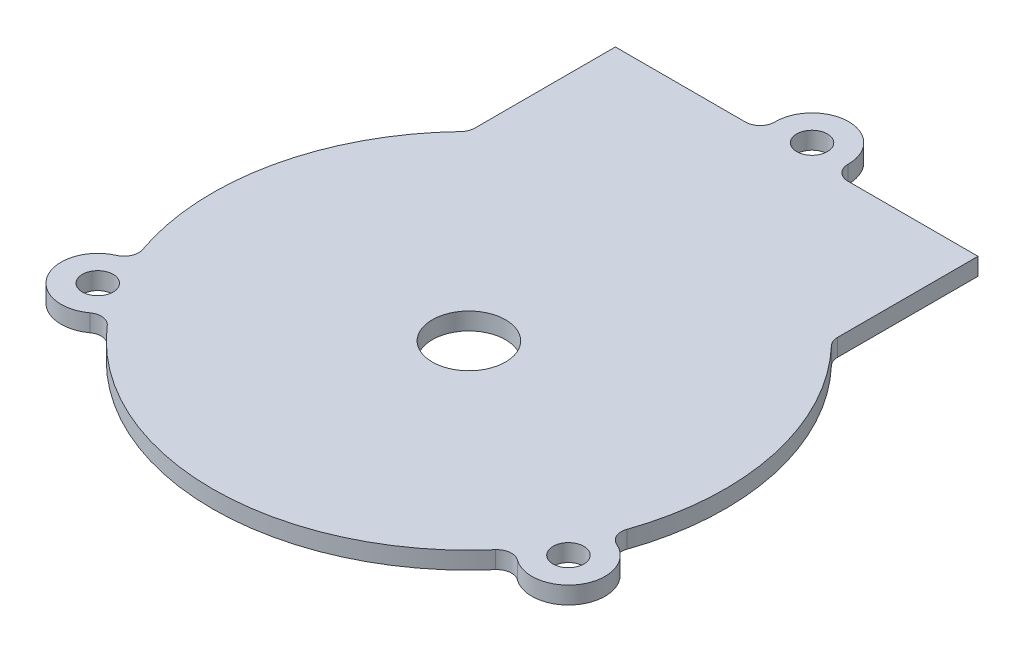
ISO-10303-21;
HEADER;
FILE_DESCRIPTION(('STEP AP214'),'2;1');
FILE_NAME('part.step','',(''),(''),'','','');
FILE_SCHEMA(('AUTOMOTIVE_DESIGN { 1 0 10303 214 1 1 1 1 }'));
ENDSEC;
DATA;
#1=APPLICATION_CONTEXT('core data for automotive mechanical design processes');
#2=APPLICATION_PROTOCOL_DEFINITION('international standard','automotive_design',2000,#1);
#3=PRODUCT_CONTEXT('',#1,'mechanical');
#4=PRODUCT('Part','Part','',(#3));
#5=PRODUCT_RELATED_PRODUCT_CATEGORY('part','',(#4));
#6=PRODUCT_DEFINITION_FORMATION('','',#4);
#7=PRODUCT_DEFINITION_CONTEXT('part definition',#1,'design');
#8=PRODUCT_DEFINITION('design','',#6,#7);
#9=PRODUCT_DEFINITION_SHAPE('','',#8);
#10=(LENGTH_UNIT() NAMED_UNIT(*) SI_UNIT(.MILLI.,.METRE.));
#11=(NAMED_UNIT(*) PLANE_ANGLE_UNIT() SI_UNIT($,.RADIAN.));
#12=(NAMED_UNIT(*) SI_UNIT($,.STERADIAN.) SOLID_ANGLE_UNIT());
#13=UNCERTAINTY_MEASURE_WITH_UNIT(LENGTH_MEASURE(1.E-05),#10,'distance_accuracy_value','');
#14=(GEOMETRIC_REPRESENTATION_CONTEXT(3) GLOBAL_UNCERTAINTY_ASSIGNED_CONTEXT((#13)) GLOBAL_UNIT_ASSIGNED_CONTEXT((#10,
#11,#12)) REPRESENTATION_CONTEXT('',''));
#15=CARTESIAN_POINT('',(0.,0.,0.));
#16=DIRECTION('',(0.,0.,1.));
#17=DIRECTION('',(1.,0.,0.));
#18=AXIS2_PLACEMENT_3D('',#15,#16,#17);
#19=CARTESIAN_POINT('',(0.,2.3622,0.));
#20=DIRECTION('',(0.,-1.,0.));
#21=DIRECTION('',(0.,0.,-1.));
#22=AXIS2_PLACEMENT_3D('',#19,#20,#21);
#23=CYLINDRICAL_SURFACE('',#22,35.);
#24=CARTESIAN_POINT('',(0.,0.,0.));
#25=DIRECTION('',(0.,1.,0.));
#26=DIRECTION('',(0.,0.,1.));
#27=AXIS2_PLACEMENT_3D('',#24,#25,#26);
#28=CIRCLE('',#27,35.);
#29=CARTESIAN_POINT('',(-25.3019754085747,0.,-24.1828459951239));
#30=VERTEX_POINT('',#29);
#31=CARTESIAN_POINT('',(-33.072840065109,0.,11.4537002766671));
#32=VERTEX_POINT('',#31);
#33=EDGE_CURVE('E213',#30,#32,#28,.T.);
#34=ORIENTED_EDGE('',*,*,#33,.T.);
#35=DIRECTION('',(0.,-1.,0.));
#36=VECTOR('',#35,1.);
#37=CARTESIAN_POINT('',(-33.072840065109,2.3622,11.4537002766671));
#38=LINE('',#37,#36);
#39=CARTESIAN_POINT('',(-33.072840065109,2.3622,11.4537002766671));
#40=VERTEX_POINT('',#39);
#41=EDGE_CURVE('E226',#32,#40,#38,.F.);
#42=ORIENTED_EDGE('',*,*,#41,.T.);
#43=CARTESIAN_POINT('',(0.,2.3622,0.));
#44=DIRECTION('',(0.,1.,0.));
#45=DIRECTION('',(0.,0.,1.));
#46=AXIS2_PLACEMENT_3D('',#43,#44,#45);
#47=CIRCLE('',#46,35.);
#48=CARTESIAN_POINT('',(-25.3019754085747,2.3622,-24.1828459951239));
#49=VERTEX_POINT('',#48);
#50=EDGE_CURVE('E207',#49,#40,#47,.T.);
#51=ORIENTED_EDGE('',*,*,#50,.F.);
#52=DIRECTION('',(0.,-1.,0.));
#53=VECTOR('',#52,1.);
#54=CARTESIAN_POINT('',(-25.3019754085747,2.3622,-24.1828459951239));
#55=LINE('',#54,#53);
#56=EDGE_CURVE('E220',#49,#30,#55,.T.);
#57=ORIENTED_EDGE('',*,*,#56,.T.);
#58=EDGE_LOOP('',(#34,#42,#51,#57));
#59=FACE_BOUND('',#58,.T.);
#60=ADVANCED_FACE('F45',(#59),#23,.T.);
#61=CARTESIAN_POINT('',(-26.5021889393046,0.,22.8611894140572));
#62=VERTEX_POINT('',#61);
#63=CARTESIAN_POINT('',(26.4887144081727,0.,22.8768006723464));
#64=VERTEX_POINT('',#63);
#65=EDGE_CURVE('E216',#62,#64,#28,.T.);
#66=ORIENTED_EDGE('',*,*,#65,.T.);
#67=DIRECTION('',(0.,-1.,0.));
#68=VECTOR('',#67,1.);
#69=CARTESIAN_POINT('',(26.4887144081727,2.3622,22.8768006723464));
#70=LINE('',#69,#68);
#71=CARTESIAN_POINT('',(26.4887144081727,2.3622,22.8768006723464));
#72=VERTEX_POINT('',#71);
#73=EDGE_CURVE('E245',#64,#72,#70,.F.);
#74=ORIENTED_EDGE('',*,*,#73,.T.);
#75=CARTESIAN_POINT('',(-26.5021889393046,2.3622,22.8611894140572));
#76=VERTEX_POINT('',#75);
#77=EDGE_CURVE('E211',#76,#72,#47,.T.);
#78=ORIENTED_EDGE('',*,*,#77,.F.);
#79=DIRECTION('',(0.,-1.,0.));
#80=VECTOR('',#79,1.);
#81=CARTESIAN_POINT('',(-26.5021889393046,2.3622,22.8611894140572));
#82=LINE('',#81,#80);
#83=EDGE_CURVE('E236',#76,#62,#82,.T.);
#84=ORIENTED_EDGE('',*,*,#83,.T.);
#85=EDGE_LOOP('',(#66,#74,#78,#84));
#86=FACE_BOUND('',#85,.T.);
#87=ADVANCED_FACE('F368',(#86),#23,.T.);
#88=CARTESIAN_POINT('',(-24.7478605121482,-53.381962685779,-44.7452325826062));
#89=DIRECTION('',(3.0206381024394E-06,0.,0.999999999995438));
#90=DIRECTION('',(0.999999999995438,0.,-3.0206381024394E-06));
#91=AXIS2_PLACEMENT_3D('',#88,#89,#90);
#92=PLANE('',#91);
#93=DIRECTION('',(0.999999999995438,0.,-3.0206381024394E-06));
#94=VECTOR('',#93,1.);
#95=CARTESIAN_POINT('',(-24.7478605121482,2.3622,-44.7452325826062));
#96=LINE('',#95,#94);
#97=CARTESIAN_POINT('',(-24.7478605121482,2.3622,-44.7452325826062));
#98=VERTEX_POINT('',#97);
#99=CARTESIAN_POINT('',(-6.99532394188785,2.3622,-44.7452862065945));
#100=VERTEX_POINT('',#99);
#101=EDGE_CURVE('E179',#98,#100,#96,.T.);
#102=ORIENTED_EDGE('',*,*,#101,.T.);
#103=DIRECTION('',(0.,1.,0.));
#104=VECTOR('',#103,1.);
#105=CARTESIAN_POINT('',(-6.99532394188785,-53.381962685779,-44.7452862065945));
#106=LINE('',#105,#104);
#107=CARTESIAN_POINT('',(-6.99532394188785,0.,-44.7452862065945));
#108=VERTEX_POINT('',#107);
#109=EDGE_CURVE('E280',#100,#108,#106,.F.);
#110=ORIENTED_EDGE('',*,*,#109,.T.);
#111=DIRECTION('',(-0.999999999995438,0.,3.0206381024394E-06));
#112=VECTOR('',#111,1.);
#113=CARTESIAN_POINT('',(-24.7478605121482,0.,-44.7452325826062));
#114=LINE('',#113,#112);
#115=CARTESIAN_POINT('',(-24.7478605121482,0.,-44.7452325826062));
#116=VERTEX_POINT('',#115);
#117=EDGE_CURVE('E200',#108,#116,#114,.T.);
#118=ORIENTED_EDGE('',*,*,#117,.T.);
#119=DIRECTION('',(0.,1.,0.));
#120=VECTOR('',#119,1.);
#121=CARTESIAN_POINT('',(-24.7478605121482,-53.381962685779,-44.7452325826062));
#122=LINE('',#121,#120);
#123=EDGE_CURVE('E196',#116,#98,#122,.T.);
#124=ORIENTED_EDGE('',*,*,#123,.T.);
#125=EDGE_LOOP('',(#102,#110,#118,#124));
#126=FACE_BOUND('',#125,.T.);
#127=ADVANCED_FACE('F286',(#126),#92,.F.);
#128=CARTESIAN_POINT('',(33.0630730181294,0.,11.4818640733046));
#129=VERTEX_POINT('',#128);
#130=CARTESIAN_POINT('',(25.3018293128609,0.,-24.1829988509046));
#131=VERTEX_POINT('',#130);
#132=EDGE_CURVE('E217',#129,#131,#28,.T.);
#133=ORIENTED_EDGE('',*,*,#132,.T.);
#134=DIRECTION('',(0.,-1.,0.));
#135=VECTOR('',#134,1.);
#136=CARTESIAN_POINT('',(25.3018293128609,2.3622,-24.1829988509046));
#137=LINE('',#136,#135);
#138=CARTESIAN_POINT('',(25.3018293128609,2.3622,-24.1829988509046));
#139=VERTEX_POINT('',#138);
#140=EDGE_CURVE('E264',#131,#139,#137,.F.);
#141=ORIENTED_EDGE('',*,*,#140,.T.);
#142=CARTESIAN_POINT('',(33.0630730181294,2.3622,11.4818640733046));
#143=VERTEX_POINT('',#142);
#144=EDGE_CURVE('E212',#143,#139,#47,.T.);
#145=ORIENTED_EDGE('',*,*,#144,.F.);
#146=DIRECTION('',(0.,-1.,0.));
#147=VECTOR('',#146,1.);
#148=CARTESIAN_POINT('',(33.0630730181294,2.3622,11.4818640733046));
#149=LINE('',#148,#147);
#150=EDGE_CURVE('E255',#143,#129,#149,.T.);
#151=ORIENTED_EDGE('',*,*,#150,.T.);
#152=EDGE_LOOP('',(#133,#141,#145,#151));
#153=FACE_BOUND('',#152,.T.);
#154=ADVANCED_FACE('F345',(#153),#23,.T.);
#155=CARTESIAN_POINT('',(0.,2.3622,0.));
#156=DIRECTION('',(0.,1.,0.));
#157=DIRECTION('',(0.,0.,1.));
#158=AXIS2_PLACEMENT_3D('',#155,#156,#157);
#159=PLANE('',#158);
#160=CARTESIAN_POINT('',(0.,2.3622,0.));
#161=DIRECTION('',(0.,1.,0.));
#162=DIRECTION('',(0.,0.,1.));
#163=AXIS2_PLACEMENT_3D('',#160,#161,#162);
#164=CIRCLE('',#163,5.);
#165=CARTESIAN_POINT('',(0.,2.3622,5.));
#166=VERTEX_POINT('',#165);
#167=EDGE_CURVE('E337',#166,#166,#164,.T.);
#168=ORIENTED_EDGE('',*,*,#167,.F.);
#169=EDGE_LOOP('',(#168));
#170=FACE_BOUND('',#169,.T.);
#171=CARTESIAN_POINT('',(-32.1480166138315,2.3622,18.5087961651664));
#172=DIRECTION('',(0.,1.,0.));
#173=DIRECTION('',(0.,0.,1.));
#174=AXIS2_PLACEMENT_3D('',#171,#172,#173);
#175=CIRCLE('',#174,2.09999999999999);
#176=CARTESIAN_POINT('',(-32.1480166138315,2.3622,20.6087961651664));
#177=VERTEX_POINT('',#176);
#178=EDGE_CURVE('E331',#177,#177,#175,.T.);
#179=ORIENTED_EDGE('',*,*,#178,.F.);
#180=EDGE_LOOP('',(#179));
#181=FACE_BOUND('',#180,.T.);
#182=DIRECTION('',(-3.02063810260161E-06,0.,-0.999999999995438));
#183=VECTOR('',#182,1.);
#184=CARTESIAN_POINT('',(-24.7478001128037,2.3622,-24.7496745347634));
#185=LINE('',#184,#183);
#186=CARTESIAN_POINT('',(-24.7478025747881,2.3622,-25.5647289504072));
#187=VERTEX_POINT('',#186);
#188=EDGE_CURVE('E197',#187,#98,#185,.T.);
#189=ORIENTED_EDGE('',*,*,#188,.F.);
#190=CARTESIAN_POINT('',(-26.747802574779,2.3622,-25.564722909131));
#191=DIRECTION('',(0.,1.,0.));
#192=DIRECTION('',(0.,0.,1.));
#193=AXIS2_PLACEMENT_3D('',#190,#191,#192);
#194=CIRCLE('',#193,2.);
#195=EDGE_CURVE('E222',#187,#49,#194,.F.);
#196=ORIENTED_EDGE('',*,*,#195,.T.);
#197=ORIENTED_EDGE('',*,*,#50,.T.);
#198=CARTESIAN_POINT('',(-34.9627166402581,2.3622,12.1081974353338));
#199=DIRECTION('',(0.,1.,0.));
#200=DIRECTION('',(0.,0.,1.));
#201=AXIS2_PLACEMENT_3D('',#198,#199,#200);
#202=CIRCLE('',#201,2.);
#203=CARTESIAN_POINT('',(-34.1580179965192,2.3622,13.9391698799011));
#204=VERTEX_POINT('',#203);
#205=EDGE_CURVE('E232',#40,#204,#202,.F.);
#206=ORIENTED_EDGE('',*,*,#205,.T.);
#207=CARTESIAN_POINT('',(-32.1464555555357,2.3622,18.5161819435163));
#208=DIRECTION('',(0.,1.,0.));
#209=DIRECTION('',(0.,0.,1.));
#210=AXIS2_PLACEMENT_3D('',#207,#208,#209);
#211=CIRCLE('',#210,4.99954226749351);
#212=CARTESIAN_POINT('',(-29.1966357044392,2.3622,22.5527628891349));
#213=VERTEX_POINT('',#212);
#214=EDGE_CURVE('E325',#204,#213,#211,.T.);
#215=ORIENTED_EDGE('',*,*,#214,.T.);
#216=CARTESIAN_POINT('',(-28.0165997358363,2.3622,24.1675430948605));
#217=DIRECTION('',(0.,1.,0.));
#218=DIRECTION('',(0.,0.,1.));
#219=AXIS2_PLACEMENT_3D('',#216,#217,#218);
#220=CIRCLE('',#219,2.);
#221=EDGE_CURVE('E243',#213,#76,#220,.F.);
#222=ORIENTED_EDGE('',*,*,#221,.T.);
#223=ORIENTED_EDGE('',*,*,#77,.T.);
#224=CARTESIAN_POINT('',(28.0023552314968,2.3622,24.1840464250519));
#225=DIRECTION('',(0.,1.,0.));
#226=DIRECTION('',(0.,0.,1.));
#227=AXIS2_PLACEMENT_3D('',#224,#225,#226);
#228=CIRCLE('',#227,2.);
#229=CARTESIAN_POINT('',(29.184359284545,2.3622,22.5707062815676));
#230=VERTEX_POINT('',#229);
#231=EDGE_CURVE('E251',#72,#230,#228,.F.);
#232=ORIENTED_EDGE('',*,*,#231,.T.);
#233=CARTESIAN_POINT('',(32.1364886347761,2.3622,18.5412879583363));
#234=DIRECTION('',(0.,1.,0.));
#235=DIRECTION('',(0.,0.,1.));
#236=AXIS2_PLACEMENT_3D('',#233,#234,#235);
#237=CIRCLE('',#236,4.9951255964279);
#238=CARTESIAN_POINT('',(34.147287178261,2.3622,13.9687647007018));
#239=VERTEX_POINT('',#238);
#240=EDGE_CURVE('E314',#230,#239,#237,.T.);
#241=ORIENTED_EDGE('',*,*,#240,.T.);
#242=CARTESIAN_POINT('',(34.9523914763083,2.3622,12.1379705917791));
#243=DIRECTION('',(0.,1.,0.));
#244=DIRECTION('',(0.,0.,1.));
#245=AXIS2_PLACEMENT_3D('',#242,#243,#244);
#246=CIRCLE('',#245,2.);
#247=EDGE_CURVE('E262',#239,#143,#246,.F.);
#248=ORIENTED_EDGE('',*,*,#247,.T.);
#249=ORIENTED_EDGE('',*,*,#144,.T.);
#250=CARTESIAN_POINT('',(26.7476481307387,2.3622,-25.5648844995277));
#251=DIRECTION('',(0.,1.,0.));
#252=DIRECTION('',(0.,0.,1.));
#253=AXIS2_PLACEMENT_3D('',#250,#251,#252);
#254=CIRCLE('',#253,2.);
#255=CARTESIAN_POINT('',(24.7476481307478,2.3622,-25.5648784582515));
#256=VERTEX_POINT('',#255);
#257=EDGE_CURVE('E187',#139,#256,#254,.F.);
#258=ORIENTED_EDGE('',*,*,#257,.T.);
#259=DIRECTION('',(-3.02063810260161E-06,0.,-0.999999999995438));
#260=VECTOR('',#259,1.);
#261=CARTESIAN_POINT('',(24.7476505927322,2.3622,-24.7498240426077));
#262=LINE('',#261,#260);
#263=CARTESIAN_POINT('',(24.7475901933877,2.3622,-44.7453820904505));
#264=VERTEX_POINT('',#263);
#265=EDGE_CURVE('E180',#256,#264,#262,.T.);
#266=ORIENTED_EDGE('',*,*,#265,.T.);
#267=CARTESIAN_POINT('',(6.99533660471705,2.3622,-44.7453284673169));
#268=VERTEX_POINT('',#267);
#269=EDGE_CURVE('E170',#268,#264,#96,.T.);
#270=ORIENTED_EDGE('',*,*,#269,.F.);
#271=CARTESIAN_POINT('',(6.99533056344084,2.3622,-46.7453284673078));
#272=DIRECTION('',(0.,1.,0.));
#273=DIRECTION('',(0.,0.,1.));
#274=AXIS2_PLACEMENT_3D('',#271,#272,#273);
#275=CIRCLE('',#274,2.);
#276=CARTESIAN_POINT('',(4.99551899083441,2.3622,-46.7727815922561));
#277=VERTEX_POINT('',#276);
#278=EDGE_CURVE('E276',#268,#277,#275,.F.);
#279=ORIENTED_EDGE('',*,*,#278,.T.);
#280=CARTESIAN_POINT('',(0.,2.3622,-46.8413593567393));
#281=DIRECTION('',(0.,1.,0.));
#282=DIRECTION('',(0.,0.,1.));
#283=AXIS2_PLACEMENT_3D('',#280,#281,#282);
#284=CIRCLE('',#283,4.99598968149142);
#285=CARTESIAN_POINT('',(-4.99551857644603,2.3622,-46.7727514129473));
#286=VERTEX_POINT('',#285);
#287=EDGE_CURVE('E306',#277,#286,#284,.T.);
#288=ORIENTED_EDGE('',*,*,#287,.T.);
#289=CARTESIAN_POINT('',(-6.99532998316405,2.3622,-46.7452862065854));
#290=DIRECTION('',(0.,1.,0.));
#291=DIRECTION('',(0.,0.,1.));
#292=AXIS2_PLACEMENT_3D('',#289,#290,#291);
#293=CIRCLE('',#292,2.);
#294=EDGE_CURVE('E12',#286,#100,#293,.F.);
#295=ORIENTED_EDGE('',*,*,#294,.T.);
#296=ORIENTED_EDGE('',*,*,#101,.F.);
#297=EDGE_LOOP('',(#189,#196,#197,#206,#215,#222,#223,#232,#241,#248,#249,#258,#266,#270,#279,
#288,#295,#296));
#298=FACE_BOUND('',#297,.T.);
#299=CARTESIAN_POINT('',(32.1247811991366,2.3622,18.5356173256723));
#300=DIRECTION('',(0.,1.,0.));
#301=DIRECTION('',(0.,0.,1.));
#302=AXIS2_PLACEMENT_3D('',#299,#300,#301);
#303=CIRCLE('',#302,2.1);
#304=CARTESIAN_POINT('',(32.1247811991366,2.3622,20.6356173256723));
#305=VERTEX_POINT('',#304);
#306=EDGE_CURVE('E320',#305,#305,#303,.T.);
#307=ORIENTED_EDGE('',*,*,#306,.F.);
#308=EDGE_LOOP('',(#307));
#309=FACE_BOUND('',#308,.T.);
#310=CARTESIAN_POINT('',(0.,2.3622,-46.8413593567393));
#311=DIRECTION('',(0.,1.,0.));
#312=DIRECTION('',(0.,0.,1.));
#313=AXIS2_PLACEMENT_3D('',#310,#311,#312);
#314=CIRCLE('',#313,2.09605202456873);
#315=CARTESIAN_POINT('',(0.,2.3622,-44.7453073321706));
#316=VERTEX_POINT('',#315);
#317=EDGE_CURVE('E308',#316,#316,#314,.T.);
#318=ORIENTED_EDGE('',*,*,#317,.F.);
#319=EDGE_LOOP('',(#318));
#320=FACE_BOUND('',#319,.T.);
#321=ADVANCED_FACE('F184',(#170,#181,#298,#309,#320),#159,.T.);
#322=CARTESIAN_POINT('',(0.,0.,0.));
#323=DIRECTION('',(0.,1.,0.));
#324=DIRECTION('',(0.,0.,1.));
#325=AXIS2_PLACEMENT_3D('',#322,#323,#324);
#326=PLANE('',#325);
#327=CARTESIAN_POINT('',(0.,0.,0.));
#328=DIRECTION('',(0.,1.,0.));
#329=DIRECTION('',(0.,0.,1.));
#330=AXIS2_PLACEMENT_3D('',#327,#328,#329);
#331=CIRCLE('',#330,5.);
#332=CARTESIAN_POINT('',(0.,0.,5.));
#333=VERTEX_POINT('',#332);
#334=EDGE_CURVE('E334',#333,#333,#331,.F.);
#335=ORIENTED_EDGE('',*,*,#334,.F.);
#336=EDGE_LOOP('',(#335));
#337=FACE_BOUND('',#336,.T.);
#338=CARTESIAN_POINT('',(-32.1480166138315,0.,18.5087961651664));
#339=DIRECTION('',(0.,1.,0.));
#340=DIRECTION('',(0.,0.,1.));
#341=AXIS2_PLACEMENT_3D('',#338,#339,#340);
#342=CIRCLE('',#341,2.1);
#343=CARTESIAN_POINT('',(-32.1480166138315,0.,20.6087961651664));
#344=VERTEX_POINT('',#343);
#345=EDGE_CURVE('E328',#344,#344,#342,.T.);
#346=ORIENTED_EDGE('',*,*,#345,.T.);
#347=EDGE_LOOP('',(#346));
#348=FACE_BOUND('',#347,.T.);
#349=CARTESIAN_POINT('',(32.1247811991366,0.,18.5356173256723));
#350=DIRECTION('',(0.,1.,0.));
#351=DIRECTION('',(0.,0.,1.));
#352=AXIS2_PLACEMENT_3D('',#349,#350,#351);
#353=CIRCLE('',#352,2.1);
#354=CARTESIAN_POINT('',(32.1247811991366,0.,20.6356173256723));
#355=VERTEX_POINT('',#354);
#356=EDGE_CURVE('E317',#355,#355,#353,.T.);
#357=ORIENTED_EDGE('',*,*,#356,.T.);
#358=EDGE_LOOP('',(#357));
#359=FACE_BOUND('',#358,.T.);
#360=CARTESIAN_POINT('',(0.,0.,-46.8413593567393));
#361=DIRECTION('',(0.,1.,0.));
#362=DIRECTION('',(0.,0.,1.));
#363=AXIS2_PLACEMENT_3D('',#360,#361,#362);
#364=CIRCLE('',#363,2.09605202456873);
#365=CARTESIAN_POINT('',(0.,0.,-44.7453073321706));
#366=VERTEX_POINT('',#365);
#367=EDGE_CURVE('E190',#366,#366,#364,.F.);
#368=ORIENTED_EDGE('',*,*,#367,.F.);
#369=EDGE_LOOP('',(#368));
#370=FACE_BOUND('',#369,.T.);
#371=ORIENTED_EDGE('',*,*,#65,.F.);
#372=CARTESIAN_POINT('',(-28.0165997358363,0.,24.1675430948605));
#373=DIRECTION('',(0.,1.,0.));
#374=DIRECTION('',(0.,0.,1.));
#375=AXIS2_PLACEMENT_3D('',#372,#373,#374);
#376=CIRCLE('',#375,2.);
#377=CARTESIAN_POINT('',(-29.1966357044392,0.,22.5527628891349));
#378=VERTEX_POINT('',#377);
#379=EDGE_CURVE('E241',#62,#378,#376,.T.);
#380=ORIENTED_EDGE('',*,*,#379,.T.);
#381=CARTESIAN_POINT('',(-32.1464555555357,0.,18.5161819435163));
#382=DIRECTION('',(0.,1.,0.));
#383=DIRECTION('',(0.,0.,1.));
#384=AXIS2_PLACEMENT_3D('',#381,#382,#383);
#385=CIRCLE('',#384,4.99954226749351);
#386=CARTESIAN_POINT('',(-34.1580179965192,0.,13.9391698799011));
#387=VERTEX_POINT('',#386);
#388=EDGE_CURVE('E323',#378,#387,#385,.F.);
#389=ORIENTED_EDGE('',*,*,#388,.T.);
#390=CARTESIAN_POINT('',(-34.9627166402581,0.,12.1081974353338));
#391=DIRECTION('',(0.,1.,0.));
#392=DIRECTION('',(0.,0.,1.));
#393=AXIS2_PLACEMENT_3D('',#390,#391,#392);
#394=CIRCLE('',#393,2.);
#395=EDGE_CURVE('E234',#387,#32,#394,.T.);
#396=ORIENTED_EDGE('',*,*,#395,.T.);
#397=ORIENTED_EDGE('',*,*,#33,.F.);
#398=CARTESIAN_POINT('',(-26.747802574779,0.,-25.564722909131));
#399=DIRECTION('',(0.,1.,0.));
#400=DIRECTION('',(0.,0.,1.));
#401=AXIS2_PLACEMENT_3D('',#398,#399,#400);
#402=CIRCLE('',#401,2.);
#403=CARTESIAN_POINT('',(-24.7478025747881,0.,-25.5647289504072));
#404=VERTEX_POINT('',#403);
#405=EDGE_CURVE('E224',#30,#404,#402,.T.);
#406=ORIENTED_EDGE('',*,*,#405,.T.);
#407=DIRECTION('',(3.02063810260161E-06,0.,0.999999999995438));
#408=VECTOR('',#407,1.);
#409=CARTESIAN_POINT('',(-24.7478001128037,0.,-24.7496745347634));
#410=LINE('',#409,#408);
#411=EDGE_CURVE('E206',#116,#404,#410,.T.);
#412=ORIENTED_EDGE('',*,*,#411,.F.);
#413=ORIENTED_EDGE('',*,*,#117,.F.);
#414=CARTESIAN_POINT('',(-6.99532998316405,0.,-46.7452862065854));
#415=DIRECTION('',(0.,1.,0.));
#416=DIRECTION('',(0.,0.,1.));
#417=AXIS2_PLACEMENT_3D('',#414,#415,#416);
#418=CIRCLE('',#417,2.);
#419=CARTESIAN_POINT('',(-4.99551857644603,0.,-46.7727514129473));
#420=VERTEX_POINT('',#419);
#421=EDGE_CURVE('E53',#108,#420,#418,.T.);
#422=ORIENTED_EDGE('',*,*,#421,.T.);
#423=CARTESIAN_POINT('',(0.,0.,-46.8413593567393));
#424=DIRECTION('',(0.,1.,0.));
#425=DIRECTION('',(0.,0.,1.));
#426=AXIS2_PLACEMENT_3D('',#423,#424,#425);
#427=CIRCLE('',#426,4.99598968149142);
#428=CARTESIAN_POINT('',(4.99551899083441,0.,-46.7727815922561));
#429=VERTEX_POINT('',#428);
#430=EDGE_CURVE('E305',#420,#429,#427,.F.);
#431=ORIENTED_EDGE('',*,*,#430,.T.);
#432=CARTESIAN_POINT('',(6.99533056344084,0.,-46.7453284673078));
#433=DIRECTION('',(0.,1.,0.));
#434=DIRECTION('',(0.,0.,1.));
#435=AXIS2_PLACEMENT_3D('',#432,#433,#434);
#436=CIRCLE('',#435,2.);
#437=CARTESIAN_POINT('',(6.99533660471705,0.,-44.7453284673169));
#438=VERTEX_POINT('',#437);
#439=EDGE_CURVE('E278',#429,#438,#436,.T.);
#440=ORIENTED_EDGE('',*,*,#439,.T.);
#441=CARTESIAN_POINT('',(24.7475901933877,0.,-44.7453820904505));
#442=VERTEX_POINT('',#441);
#443=EDGE_CURVE('E204',#442,#438,#114,.T.);
#444=ORIENTED_EDGE('',*,*,#443,.F.);
#445=DIRECTION('',(3.02063810260161E-06,0.,0.999999999995438));
#446=VECTOR('',#445,1.);
#447=CARTESIAN_POINT('',(24.7476505927322,0.,-24.7498240426077));
#448=LINE('',#447,#446);
#449=CARTESIAN_POINT('',(24.7476481307478,0.,-25.5648784582515));
#450=VERTEX_POINT('',#449);
#451=EDGE_CURVE('E195',#442,#450,#448,.T.);
#452=ORIENTED_EDGE('',*,*,#451,.T.);
#453=CARTESIAN_POINT('',(26.7476481307387,0.,-25.5648844995277));
#454=DIRECTION('',(0.,1.,0.));
#455=DIRECTION('',(0.,0.,1.));
#456=AXIS2_PLACEMENT_3D('',#453,#454,#455);
#457=CIRCLE('',#456,2.);
#458=EDGE_CURVE('E270',#450,#131,#457,.T.);
#459=ORIENTED_EDGE('',*,*,#458,.T.);
#460=ORIENTED_EDGE('',*,*,#132,.F.);
#461=CARTESIAN_POINT('',(34.9523914763083,0.,12.1379705917791));
#462=DIRECTION('',(0.,1.,0.));
#463=DIRECTION('',(0.,0.,1.));
#464=AXIS2_PLACEMENT_3D('',#461,#462,#463);
#465=CIRCLE('',#464,2.);
#466=CARTESIAN_POINT('',(34.147287178261,0.,13.9687647007018));
#467=VERTEX_POINT('',#466);
#468=EDGE_CURVE('E260',#129,#467,#465,.T.);
#469=ORIENTED_EDGE('',*,*,#468,.T.);
#470=CARTESIAN_POINT('',(32.1364886347761,0.,18.5412879583363));
#471=DIRECTION('',(0.,1.,0.));
#472=DIRECTION('',(0.,0.,1.));
#473=AXIS2_PLACEMENT_3D('',#470,#471,#472);
#474=CIRCLE('',#473,4.9951255964279);
#475=CARTESIAN_POINT('',(29.184359284545,0.,22.5707062815676));
#476=VERTEX_POINT('',#475);
#477=EDGE_CURVE('E311',#467,#476,#474,.F.);
#478=ORIENTED_EDGE('',*,*,#477,.T.);
#479=CARTESIAN_POINT('',(28.0023552314968,0.,24.1840464250519));
#480=DIRECTION('',(0.,1.,0.));
#481=DIRECTION('',(0.,0.,1.));
#482=AXIS2_PLACEMENT_3D('',#479,#480,#481);
#483=CIRCLE('',#482,2.);
#484=EDGE_CURVE('E253',#476,#64,#483,.T.);
#485=ORIENTED_EDGE('',*,*,#484,.T.);
#486=EDGE_LOOP('',(#371,#380,#389,#396,#397,#406,#412,#413,#422,#431,#440,#444,#452,#459,#460,
#469,#478,#485));
#487=FACE_BOUND('',#486,.T.);
#488=ADVANCED_FACE('F292',(#337,#348,#359,#370,#487),#326,.F.);
#489=ORIENTED_EDGE('',*,*,#443,.T.);
#490=DIRECTION('',(0.,1.,0.));
#491=VECTOR('',#490,1.);
#492=CARTESIAN_POINT('',(6.99533660471704,-53.381962685779,-44.7453284673169));
#493=LINE('',#492,#491);
#494=EDGE_CURVE('E177',#438,#268,#493,.T.);
#495=ORIENTED_EDGE('',*,*,#494,.T.);
#496=ORIENTED_EDGE('',*,*,#269,.T.);
#497=DIRECTION('',(0.,1.,0.));
#498=VECTOR('',#497,1.);
#499=CARTESIAN_POINT('',(24.7475901933877,-53.381962685779,-44.7453820904505));
#500=LINE('',#499,#498);
#501=EDGE_CURVE('E175',#442,#264,#500,.T.);
#502=ORIENTED_EDGE('',*,*,#501,.F.);
#503=EDGE_LOOP('',(#489,#495,#496,#502));
#504=FACE_BOUND('',#503,.T.);
#505=ADVANCED_FACE('F173',(#504),#92,.F.);
#506=CARTESIAN_POINT('',(-24.7478001128037,-53.381962685779,-24.7496745347634));
#507=DIRECTION('',(0.999999999995438,0.,-3.02063810260161E-06));
#508=DIRECTION('',(-3.02063810260161E-06,0.,-0.999999999995438));
#509=AXIS2_PLACEMENT_3D('',#506,#507,#508);
#510=PLANE('',#509);
#511=ORIENTED_EDGE('',*,*,#411,.T.);
#512=DIRECTION('',(0.,1.,0.));
#513=VECTOR('',#512,1.);
#514=CARTESIAN_POINT('',(-24.7478025747881,2.3622,-25.5647289504072));
#515=LINE('',#514,#513);
#516=EDGE_CURVE('E210',#404,#187,#515,.T.);
#517=ORIENTED_EDGE('',*,*,#516,.T.);
#518=ORIENTED_EDGE('',*,*,#188,.T.);
#519=ORIENTED_EDGE('',*,*,#123,.F.);
#520=EDGE_LOOP('',(#511,#517,#518,#519));
#521=FACE_BOUND('',#520,.T.);
#522=ADVANCED_FACE('F300',(#521),#510,.F.);
#523=CARTESIAN_POINT('',(24.7476505927322,-53.381962685779,-24.7498240426077));
#524=DIRECTION('',(0.999999999995438,0.,-3.02063810260161E-06));
#525=DIRECTION('',(-3.02063810260161E-06,0.,-0.999999999995438));
#526=AXIS2_PLACEMENT_3D('',#523,#524,#525);
#527=PLANE('',#526);
#528=ORIENTED_EDGE('',*,*,#265,.F.);
#529=DIRECTION('',(0.,-1.,0.));
#530=VECTOR('',#529,1.);
#531=CARTESIAN_POINT('',(24.7476481307478,-53.381962685779,-25.5648784582515));
#532=LINE('',#531,#530);
#533=EDGE_CURVE('E267',#256,#450,#532,.T.);
#534=ORIENTED_EDGE('',*,*,#533,.T.);
#535=ORIENTED_EDGE('',*,*,#451,.F.);
#536=ORIENTED_EDGE('',*,*,#501,.T.);
#537=EDGE_LOOP('',(#528,#534,#535,#536));
#538=FACE_BOUND('',#537,.T.);
#539=ADVANCED_FACE('F193',(#538),#527,.T.);
#540=CARTESIAN_POINT('',(0.,-14.1307927300824,-46.8413593567393));
#541=DIRECTION('',(0.,1.,0.));
#542=DIRECTION('',(0.,0.,1.));
#543=AXIS2_PLACEMENT_3D('',#540,#541,#542);
#544=CYLINDRICAL_SURFACE('',#543,4.99598968149142);
#545=ORIENTED_EDGE('',*,*,#430,.F.);
#546=DIRECTION('',(0.,1.,0.));
#547=VECTOR('',#546,1.);
#548=CARTESIAN_POINT('',(-4.99551857644604,-14.1307927300824,-46.7727514129473));
#549=LINE('',#548,#547);
#550=EDGE_CURVE('E66',#420,#286,#549,.T.);
#551=ORIENTED_EDGE('',*,*,#550,.T.);
#552=ORIENTED_EDGE('',*,*,#287,.F.);
#553=DIRECTION('',(0.,1.,0.));
#554=VECTOR('',#553,1.);
#555=CARTESIAN_POINT('',(4.99551899083441,-14.1307927300824,-46.7727815922561));
#556=LINE('',#555,#554);
#557=EDGE_CURVE('E273',#277,#429,#556,.F.);
#558=ORIENTED_EDGE('',*,*,#557,.T.);
#559=EDGE_LOOP('',(#545,#551,#552,#558));
#560=FACE_BOUND('',#559,.T.);
#561=ADVANCED_FACE('F394',(#560),#544,.T.);
#562=CARTESIAN_POINT('',(0.,-14.1307927300824,-46.8413593567393));
#563=DIRECTION('',(0.,1.,0.));
#564=DIRECTION('',(0.,0.,1.));
#565=AXIS2_PLACEMENT_3D('',#562,#563,#564);
#566=CYLINDRICAL_SURFACE('',#565,2.09605202456873);
#567=ORIENTED_EDGE('',*,*,#317,.T.);
#568=EDGE_LOOP('',(#567));
#569=FACE_BOUND('',#568,.T.);
#570=ORIENTED_EDGE('',*,*,#367,.T.);
#571=EDGE_LOOP('',(#570));
#572=FACE_BOUND('',#571,.T.);
#573=ADVANCED_FACE('F445',(#569,#572),#566,.F.);
#574=CARTESIAN_POINT('',(32.1364886347761,-14.1283487284507,18.5412879583363));
#575=DIRECTION('',(0.,1.,0.));
#576=DIRECTION('',(0.,0.,1.));
#577=AXIS2_PLACEMENT_3D('',#574,#575,#576);
#578=CYLINDRICAL_SURFACE('',#577,4.9951255964279);
#579=ORIENTED_EDGE('',*,*,#477,.F.);
#580=DIRECTION('',(0.,1.,0.));
#581=VECTOR('',#580,1.);
#582=CARTESIAN_POINT('',(34.147287178261,-14.1283487284507,13.9687647007018));
#583=LINE('',#582,#581);
#584=EDGE_CURVE('E258',#467,#239,#583,.T.);
#585=ORIENTED_EDGE('',*,*,#584,.T.);
#586=ORIENTED_EDGE('',*,*,#240,.F.);
#587=DIRECTION('',(0.,1.,0.));
#588=VECTOR('',#587,1.);
#589=CARTESIAN_POINT('',(29.184359284545,-14.1283487284507,22.5707062815676));
#590=LINE('',#589,#588);
#591=EDGE_CURVE('E248',#230,#476,#590,.F.);
#592=ORIENTED_EDGE('',*,*,#591,.T.);
#593=EDGE_LOOP('',(#579,#585,#586,#592));
#594=FACE_BOUND('',#593,.T.);
#595=ADVANCED_FACE('F440',(#594),#578,.T.);
#596=CARTESIAN_POINT('',(32.1247811991366,2.3622,18.5356173256723));
#597=DIRECTION('',(0.,1.,0.));
#598=DIRECTION('',(0.,0.,1.));
#599=AXIS2_PLACEMENT_3D('',#596,#597,#598);
#600=CYLINDRICAL_SURFACE('',#599,2.1);
#601=ORIENTED_EDGE('',*,*,#356,.F.);
#602=EDGE_LOOP('',(#601));
#603=FACE_BOUND('',#602,.T.);
#604=ORIENTED_EDGE('',*,*,#306,.T.);
#605=EDGE_LOOP('',(#604));
#606=FACE_BOUND('',#605,.T.);
#607=ADVANCED_FACE('F362',(#603,#606),#600,.F.);
#608=CARTESIAN_POINT('',(-32.1464555555357,-14.1408409606937,18.5161819435163));
#609=DIRECTION('',(0.,1.,0.));
#610=DIRECTION('',(0.,0.,1.));
#611=AXIS2_PLACEMENT_3D('',#608,#609,#610);
#612=CYLINDRICAL_SURFACE('',#611,4.99954226749351);
#613=ORIENTED_EDGE('',*,*,#388,.F.);
#614=DIRECTION('',(0.,1.,0.));
#615=VECTOR('',#614,1.);
#616=CARTESIAN_POINT('',(-29.1966357044392,-14.1408409606937,22.5527628891349));
#617=LINE('',#616,#615);
#618=EDGE_CURVE('E239',#378,#213,#617,.T.);
#619=ORIENTED_EDGE('',*,*,#618,.T.);
#620=ORIENTED_EDGE('',*,*,#214,.F.);
#621=DIRECTION('',(0.,1.,0.));
#622=VECTOR('',#621,1.);
#623=CARTESIAN_POINT('',(-34.1580179965192,-14.1408409606937,13.9391698799011));
#624=LINE('',#623,#622);
#625=EDGE_CURVE('E229',#204,#387,#624,.F.);
#626=ORIENTED_EDGE('',*,*,#625,.T.);
#627=EDGE_LOOP('',(#613,#619,#620,#626));
#628=FACE_BOUND('',#627,.T.);
#629=ADVANCED_FACE('F352',(#628),#612,.T.);
#630=CARTESIAN_POINT('',(-32.1480166138315,2.3622,18.5087961651664));
#631=DIRECTION('',(0.,1.,0.));
#632=DIRECTION('',(0.,0.,1.));
#633=AXIS2_PLACEMENT_3D('',#630,#631,#632);
#634=CYLINDRICAL_SURFACE('',#633,2.09999999999999);
#635=ORIENTED_EDGE('',*,*,#345,.F.);
#636=EDGE_LOOP('',(#635));
#637=FACE_BOUND('',#636,.T.);
#638=ORIENTED_EDGE('',*,*,#178,.T.);
#639=EDGE_LOOP('',(#638));
#640=FACE_BOUND('',#639,.T.);
#641=ADVANCED_FACE('F349',(#637,#640),#634,.F.);
#642=CARTESIAN_POINT('',(-26.747802574779,2.3622,-25.564722909131));
#643=DIRECTION('',(0.,-1.,0.));
#644=DIRECTION('',(0.,0.,-1.));
#645=AXIS2_PLACEMENT_3D('',#642,#643,#644);
#646=CYLINDRICAL_SURFACE('',#645,2.);
#647=ORIENTED_EDGE('',*,*,#405,.F.);
#648=ORIENTED_EDGE('',*,*,#56,.F.);
#649=ORIENTED_EDGE('',*,*,#195,.F.);
#650=ORIENTED_EDGE('',*,*,#516,.F.);
#651=EDGE_LOOP('',(#647,#648,#649,#650));
#652=FACE_BOUND('',#651,.T.);
#653=ADVANCED_FACE('F351',(#652),#646,.F.);
#654=CARTESIAN_POINT('',(-34.9627166402581,-14.1408409606937,12.1081974353338));
#655=DIRECTION('',(0.,-1.,0.));
#656=DIRECTION('',(0.,0.,-1.));
#657=AXIS2_PLACEMENT_3D('',#654,#655,#656);
#658=CYLINDRICAL_SURFACE('',#657,2.);
#659=ORIENTED_EDGE('',*,*,#395,.F.);
#660=ORIENTED_EDGE('',*,*,#625,.F.);
#661=ORIENTED_EDGE('',*,*,#205,.F.);
#662=ORIENTED_EDGE('',*,*,#41,.F.);
#663=EDGE_LOOP('',(#659,#660,#661,#662));
#664=FACE_BOUND('',#663,.T.);
#665=ADVANCED_FACE('F359',(#664),#658,.F.);
#666=CARTESIAN_POINT('',(-28.0165997358363,-14.1408409606937,24.1675430948605));
#667=DIRECTION('',(0.,1.,0.));
#668=DIRECTION('',(0.,0.,1.));
#669=AXIS2_PLACEMENT_3D('',#666,#667,#668);
#670=CYLINDRICAL_SURFACE('',#669,2.);
#671=ORIENTED_EDGE('',*,*,#221,.F.);
#672=ORIENTED_EDGE('',*,*,#618,.F.);
#673=ORIENTED_EDGE('',*,*,#379,.F.);
#674=ORIENTED_EDGE('',*,*,#83,.F.);
#675=EDGE_LOOP('',(#671,#672,#673,#674));
#676=FACE_BOUND('',#675,.T.);
#677=ADVANCED_FACE('F413',(#676),#670,.F.);
#678=CARTESIAN_POINT('',(28.0023552314968,-14.1283487284507,24.1840464250519));
#679=DIRECTION('',(0.,-1.,0.));
#680=DIRECTION('',(0.,0.,-1.));
#681=AXIS2_PLACEMENT_3D('',#678,#679,#680);
#682=CYLINDRICAL_SURFACE('',#681,2.);
#683=ORIENTED_EDGE('',*,*,#484,.F.);
#684=ORIENTED_EDGE('',*,*,#591,.F.);
#685=ORIENTED_EDGE('',*,*,#231,.F.);
#686=ORIENTED_EDGE('',*,*,#73,.F.);
#687=EDGE_LOOP('',(#683,#684,#685,#686));
#688=FACE_BOUND('',#687,.T.);
#689=ADVANCED_FACE('F409',(#688),#682,.F.);
#690=CARTESIAN_POINT('',(34.9523914763083,-14.1283487284507,12.1379705917791));
#691=DIRECTION('',(0.,1.,0.));
#692=DIRECTION('',(0.,0.,1.));
#693=AXIS2_PLACEMENT_3D('',#690,#691,#692);
#694=CYLINDRICAL_SURFACE('',#693,2.);
#695=ORIENTED_EDGE('',*,*,#247,.F.);
#696=ORIENTED_EDGE('',*,*,#584,.F.);
#697=ORIENTED_EDGE('',*,*,#468,.F.);
#698=ORIENTED_EDGE('',*,*,#150,.F.);
#699=EDGE_LOOP('',(#695,#696,#697,#698));
#700=FACE_BOUND('',#699,.T.);
#701=ADVANCED_FACE('F404',(#700),#694,.F.);
#702=CARTESIAN_POINT('',(26.7476481307387,2.3622,-25.5648844995277));
#703=DIRECTION('',(0.,-1.,0.));
#704=DIRECTION('',(0.,0.,-1.));
#705=AXIS2_PLACEMENT_3D('',#702,#703,#704);
#706=CYLINDRICAL_SURFACE('',#705,2.);
#707=ORIENTED_EDGE('',*,*,#458,.F.);
#708=ORIENTED_EDGE('',*,*,#533,.F.);
#709=ORIENTED_EDGE('',*,*,#257,.F.);
#710=ORIENTED_EDGE('',*,*,#140,.F.);
#711=EDGE_LOOP('',(#707,#708,#709,#710));
#712=FACE_BOUND('',#711,.T.);
#713=ADVANCED_FACE('F389',(#712),#706,.F.);
#714=CARTESIAN_POINT('',(6.99533056344084,-14.1307927300824,-46.7453284673078));
#715=DIRECTION('',(0.,1.,0.));
#716=DIRECTION('',(0.,0.,1.));
#717=AXIS2_PLACEMENT_3D('',#714,#715,#716);
#718=CYLINDRICAL_SURFACE('',#717,2.);
#719=ORIENTED_EDGE('',*,*,#439,.F.);
#720=ORIENTED_EDGE('',*,*,#557,.F.);
#721=ORIENTED_EDGE('',*,*,#278,.F.);
#722=ORIENTED_EDGE('',*,*,#494,.F.);
#723=EDGE_LOOP('',(#719,#720,#721,#722));
#724=FACE_BOUND('',#723,.T.);
#725=ADVANCED_FACE('F392',(#724),#718,.F.);
#726=CARTESIAN_POINT('',(-6.99532998316405,-14.1307927300824,-46.7452862065854));
#727=DIRECTION('',(0.,1.,0.));
#728=DIRECTION('',(0.,0.,1.));
#729=AXIS2_PLACEMENT_3D('',#726,#727,#728);
#730=CYLINDRICAL_SURFACE('',#729,2.);
#731=ORIENTED_EDGE('',*,*,#294,.F.);
#732=ORIENTED_EDGE('',*,*,#550,.F.);
#733=ORIENTED_EDGE('',*,*,#421,.F.);
#734=ORIENTED_EDGE('',*,*,#109,.F.);
#735=EDGE_LOOP('',(#731,#732,#733,#734));
#736=FACE_BOUND('',#735,.T.);
#737=ADVANCED_FACE('F47',(#736),#730,.F.);
#738=CARTESIAN_POINT('',(0.,-14.142135623731,0.));
#739=DIRECTION('',(0.,1.,0.));
#740=DIRECTION('',(0.,0.,1.));
#741=AXIS2_PLACEMENT_3D('',#738,#739,#740);
#742=CYLINDRICAL_SURFACE('',#741,5.);
#743=ORIENTED_EDGE('',*,*,#334,.T.);
#744=EDGE_LOOP('',(#743));
#745=FACE_BOUND('',#744,.T.);
#746=ORIENTED_EDGE('',*,*,#167,.T.);
#747=EDGE_LOOP('',(#746));
#748=FACE_BOUND('',#747,.T.);
#749=ADVANCED_FACE('F341',(#745,#748),#742,.F.);
#750=CLOSED_SHELL('',(#60,#87,#127,#154,#321,#488,#505,#522,#539,#561,#573,#595,#607,#629,#641,
#653,#665,#677,#689,#701,#713,#725,#737,#749));
#751=MANIFOLD_SOLID_BREP('B2',#750);
#752=ADVANCED_BREP_SHAPE_REPRESENTATION('',(#18,#751),#14);
#753=SHAPE_DEFINITION_REPRESENTATION(#9,#752);
ENDSEC;
END-ISO-10303-21;
